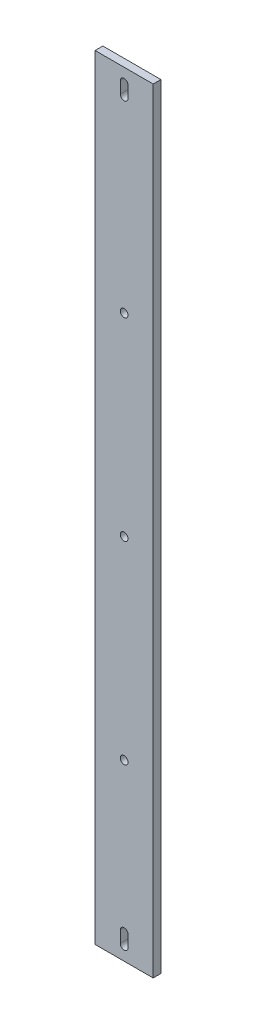
ISO-10303-21;
HEADER;
FILE_DESCRIPTION(('STEP AP214'),'2;1');
FILE_NAME('part.step','',(''),(''),'','','');
FILE_SCHEMA(('AUTOMOTIVE_DESIGN { 1 0 10303 214 1 1 1 1 }'));
ENDSEC;
DATA;
#1=APPLICATION_CONTEXT('core data for automotive mechanical design processes');
#2=APPLICATION_PROTOCOL_DEFINITION('international standard','automotive_design',2000,#1);
#3=PRODUCT_CONTEXT('',#1,'mechanical');
#4=PRODUCT('Part','Part','',(#3));
#5=PRODUCT_RELATED_PRODUCT_CATEGORY('part','',(#4));
#6=PRODUCT_DEFINITION_FORMATION('','',#4);
#7=PRODUCT_DEFINITION_CONTEXT('part definition',#1,'design');
#8=PRODUCT_DEFINITION('design','',#6,#7);
#9=PRODUCT_DEFINITION_SHAPE('','',#8);
#10=(LENGTH_UNIT() NAMED_UNIT(*) SI_UNIT(.MILLI.,.METRE.));
#11=(NAMED_UNIT(*) PLANE_ANGLE_UNIT() SI_UNIT($,.RADIAN.));
#12=(NAMED_UNIT(*) SI_UNIT($,.STERADIAN.) SOLID_ANGLE_UNIT());
#13=UNCERTAINTY_MEASURE_WITH_UNIT(LENGTH_MEASURE(1.E-05),#10,'distance_accuracy_value','');
#14=(GEOMETRIC_REPRESENTATION_CONTEXT(3) GLOBAL_UNCERTAINTY_ASSIGNED_CONTEXT((#13)) GLOBAL_UNIT_ASSIGNED_CONTEXT((#10,
#11,#12)) REPRESENTATION_CONTEXT('',''));
#15=CARTESIAN_POINT('',(0.,0.,0.));
#16=DIRECTION('',(0.,0.,1.));
#17=DIRECTION('',(1.,0.,0.));
#18=AXIS2_PLACEMENT_3D('',#15,#16,#17);
#19=CARTESIAN_POINT('',(-52.5896783947224,52.5,4.));
#20=DIRECTION('',(1.,0.,0.));
#21=DIRECTION('',(0.,1.,0.));
#22=AXIS2_PLACEMENT_3D('',#19,#20,#21);
#23=PLANE('',#22);
#24=DIRECTION('',(0.,-1.,0.));
#25=VECTOR('',#24,1.);
#26=CARTESIAN_POINT('',(-52.5896783947224,52.5,0.));
#27=LINE('',#26,#25);
#28=CARTESIAN_POINT('',(-52.5896783947224,52.5,0.));
#29=VERTEX_POINT('',#28);
#30=CARTESIAN_POINT('',(-52.5896783947223,-347.5,0.));
#31=VERTEX_POINT('',#30);
#32=EDGE_CURVE('E193',#29,#31,#27,.T.);
#33=ORIENTED_EDGE('',*,*,#32,.T.);
#34=DIRECTION('',(0.,0.,-1.));
#35=VECTOR('',#34,1.);
#36=CARTESIAN_POINT('',(-52.5896783947223,-347.5,4.));
#37=LINE('',#36,#35);
#38=CARTESIAN_POINT('',(-52.5896783947223,-347.5,4.));
#39=VERTEX_POINT('',#38);
#40=EDGE_CURVE('E11',#39,#31,#37,.T.);
#41=ORIENTED_EDGE('',*,*,#40,.F.);
#42=DIRECTION('',(0.,-1.,0.));
#43=VECTOR('',#42,1.);
#44=CARTESIAN_POINT('',(-52.5896783947224,52.5,4.));
#45=LINE('',#44,#43);
#46=CARTESIAN_POINT('',(-52.5896783947224,52.5,4.));
#47=VERTEX_POINT('',#46);
#48=EDGE_CURVE('E200',#47,#39,#45,.T.);
#49=ORIENTED_EDGE('',*,*,#48,.F.);
#50=DIRECTION('',(0.,0.,-1.));
#51=VECTOR('',#50,1.);
#52=CARTESIAN_POINT('',(-52.5896783947224,52.5,4.));
#53=LINE('',#52,#51);
#54=EDGE_CURVE('E210',#47,#29,#53,.T.);
#55=ORIENTED_EDGE('',*,*,#54,.T.);
#56=EDGE_LOOP('',(#33,#41,#49,#55));
#57=FACE_BOUND('',#56,.T.);
#58=ADVANCED_FACE('F33',(#57),#23,.F.);
#59=CARTESIAN_POINT('',(-52.5896783947223,-347.5,4.));
#60=DIRECTION('',(0.,1.,0.));
#61=DIRECTION('',(0.,0.,1.));
#62=AXIS2_PLACEMENT_3D('',#59,#60,#61);
#63=PLANE('',#62);
#64=DIRECTION('',(1.,0.,0.));
#65=VECTOR('',#64,1.);
#66=CARTESIAN_POINT('',(-52.5896783947223,-347.5,0.));
#67=LINE('',#66,#65);
#68=CARTESIAN_POINT('',(-22.5896783947223,-347.5,0.));
#69=VERTEX_POINT('',#68);
#70=EDGE_CURVE('E213',#31,#69,#67,.T.);
#71=ORIENTED_EDGE('',*,*,#70,.T.);
#72=DIRECTION('',(0.,0.,-1.));
#73=VECTOR('',#72,1.);
#74=CARTESIAN_POINT('',(-22.5896783947223,-347.5,4.));
#75=LINE('',#74,#73);
#76=CARTESIAN_POINT('',(-22.5896783947223,-347.5,4.));
#77=VERTEX_POINT('',#76);
#78=EDGE_CURVE('E40',#77,#69,#75,.T.);
#79=ORIENTED_EDGE('',*,*,#78,.F.);
#80=DIRECTION('',(1.,0.,0.));
#81=VECTOR('',#80,1.);
#82=CARTESIAN_POINT('',(-52.5896783947223,-347.5,4.));
#83=LINE('',#82,#81);
#84=EDGE_CURVE('E203',#39,#77,#83,.T.);
#85=ORIENTED_EDGE('',*,*,#84,.F.);
#86=ORIENTED_EDGE('',*,*,#40,.T.);
#87=EDGE_LOOP('',(#71,#79,#85,#86));
#88=FACE_BOUND('',#87,.T.);
#89=ADVANCED_FACE('F242',(#88),#63,.F.);
#90=CARTESIAN_POINT('',(-22.5896783947224,52.5,4.));
#91=DIRECTION('',(-1.,0.,0.));
#92=DIRECTION('',(0.,-1.,0.));
#93=AXIS2_PLACEMENT_3D('',#90,#91,#92);
#94=PLANE('',#93);
#95=DIRECTION('',(0.,1.,0.));
#96=VECTOR('',#95,1.);
#97=CARTESIAN_POINT('',(-22.5896783947224,52.5,0.));
#98=LINE('',#97,#96);
#99=CARTESIAN_POINT('',(-22.5896783947224,52.5,0.));
#100=VERTEX_POINT('',#99);
#101=EDGE_CURVE('E215',#69,#100,#98,.T.);
#102=ORIENTED_EDGE('',*,*,#101,.T.);
#103=DIRECTION('',(0.,0.,-1.));
#104=VECTOR('',#103,1.);
#105=CARTESIAN_POINT('',(-22.5896783947224,52.5,4.));
#106=LINE('',#105,#104);
#107=CARTESIAN_POINT('',(-22.5896783947224,52.5,4.));
#108=VERTEX_POINT('',#107);
#109=EDGE_CURVE('E220',#108,#100,#106,.T.);
#110=ORIENTED_EDGE('',*,*,#109,.F.);
#111=DIRECTION('',(0.,1.,0.));
#112=VECTOR('',#111,1.);
#113=CARTESIAN_POINT('',(-22.5896783947224,52.5,4.));
#114=LINE('',#113,#112);
#115=EDGE_CURVE('E206',#77,#108,#114,.T.);
#116=ORIENTED_EDGE('',*,*,#115,.F.);
#117=ORIENTED_EDGE('',*,*,#78,.T.);
#118=EDGE_LOOP('',(#102,#110,#116,#117));
#119=FACE_BOUND('',#118,.T.);
#120=ADVANCED_FACE('F227',(#119),#94,.F.);
#121=CARTESIAN_POINT('',(-52.5896783947224,52.5,4.));
#122=DIRECTION('',(0.,-1.,0.));
#123=DIRECTION('',(0.,0.,-1.));
#124=AXIS2_PLACEMENT_3D('',#121,#122,#123);
#125=PLANE('',#124);
#126=DIRECTION('',(-1.,0.,0.));
#127=VECTOR('',#126,1.);
#128=CARTESIAN_POINT('',(-52.5896783947224,52.5,0.));
#129=LINE('',#128,#127);
#130=EDGE_CURVE('E204',#100,#29,#129,.T.);
#131=ORIENTED_EDGE('',*,*,#130,.T.);
#132=ORIENTED_EDGE('',*,*,#54,.F.);
#133=DIRECTION('',(-1.,0.,0.));
#134=VECTOR('',#133,1.);
#135=CARTESIAN_POINT('',(-52.5896783947224,52.5,4.));
#136=LINE('',#135,#134);
#137=EDGE_CURVE('E208',#108,#47,#136,.T.);
#138=ORIENTED_EDGE('',*,*,#137,.F.);
#139=ORIENTED_EDGE('',*,*,#109,.T.);
#140=EDGE_LOOP('',(#131,#132,#138,#139));
#141=FACE_BOUND('',#140,.T.);
#142=ADVANCED_FACE('F235',(#141),#125,.F.);
#143=CARTESIAN_POINT('',(0.,0.,4.));
#144=DIRECTION('',(0.,0.,1.));
#145=DIRECTION('',(1.,0.,0.));
#146=AXIS2_PLACEMENT_3D('',#143,#144,#145);
#147=PLANE('',#146);
#148=CARTESIAN_POINT('',(-37.5896783947224,-157.5,4.));
#149=DIRECTION('',(0.,0.,1.));
#150=DIRECTION('',(1.,0.,0.));
#151=AXIS2_PLACEMENT_3D('',#148,#149,#150);
#152=CIRCLE('',#151,2.);
#153=CARTESIAN_POINT('',(-35.5896783947224,-157.5,4.));
#154=VERTEX_POINT('',#153);
#155=EDGE_CURVE('E304',#154,#154,#152,.T.);
#156=ORIENTED_EDGE('',*,*,#155,.F.);
#157=EDGE_LOOP('',(#156));
#158=FACE_BOUND('',#157,.T.);
#159=CARTESIAN_POINT('',(-37.5896783947224,-257.5,4.));
#160=DIRECTION('',(0.,0.,1.));
#161=DIRECTION('',(1.,0.,0.));
#162=AXIS2_PLACEMENT_3D('',#159,#160,#161);
#163=CIRCLE('',#162,1.99999999999996);
#164=CARTESIAN_POINT('',(-35.5896783947224,-257.5,4.));
#165=VERTEX_POINT('',#164);
#166=EDGE_CURVE('E145',#165,#165,#163,.T.);
#167=ORIENTED_EDGE('',*,*,#166,.F.);
#168=EDGE_LOOP('',(#167));
#169=FACE_BOUND('',#168,.T.);
#170=CARTESIAN_POINT('',(-37.5896783947224,-340.5,4.));
#171=DIRECTION('',(0.,0.,1.));
#172=DIRECTION('',(-1.,0.,0.));
#173=AXIS2_PLACEMENT_3D('',#170,#171,#172);
#174=CIRCLE('',#173,2.00000000000026);
#175=CARTESIAN_POINT('',(-39.5896783947223,-340.500001065561,4.));
#176=VERTEX_POINT('',#175);
#177=CARTESIAN_POINT('',(-35.5896783947224,-340.500001065561,4.));
#178=VERTEX_POINT('',#177);
#179=EDGE_CURVE('E47',#176,#178,#174,.T.);
#180=ORIENTED_EDGE('',*,*,#179,.F.);
#181=DIRECTION('',(0.,-1.,0.));
#182=VECTOR('',#181,1.);
#183=CARTESIAN_POINT('',(-39.5896783947223,-334.499998934439,4.));
#184=LINE('',#183,#182);
#185=CARTESIAN_POINT('',(-39.5896783947223,-334.499998934439,4.));
#186=VERTEX_POINT('',#185);
#187=EDGE_CURVE('E139',#186,#176,#184,.T.);
#188=ORIENTED_EDGE('',*,*,#187,.F.);
#189=CARTESIAN_POINT('',(-37.5896783947224,-334.499998934439,4.));
#190=DIRECTION('',(0.,0.,1.));
#191=DIRECTION('',(1.,0.,0.));
#192=AXIS2_PLACEMENT_3D('',#189,#190,#191);
#193=CIRCLE('',#192,1.99999999999998);
#194=CARTESIAN_POINT('',(-35.5896783947224,-334.499998934439,4.));
#195=VERTEX_POINT('',#194);
#196=EDGE_CURVE('E142',#195,#186,#193,.T.);
#197=ORIENTED_EDGE('',*,*,#196,.F.);
#198=DIRECTION('',(0.,1.,0.));
#199=VECTOR('',#198,1.);
#200=CARTESIAN_POINT('',(-35.5896783947224,-334.499998934439,4.));
#201=LINE('',#200,#199);
#202=EDGE_CURVE('E151',#178,#195,#201,.T.);
#203=ORIENTED_EDGE('',*,*,#202,.F.);
#204=EDGE_LOOP('',(#180,#188,#197,#203));
#205=FACE_BOUND('',#204,.T.);
#206=CARTESIAN_POINT('',(-37.5896783947224,-57.5,4.));
#207=DIRECTION('',(0.,0.,1.));
#208=DIRECTION('',(1.,0.,0.));
#209=AXIS2_PLACEMENT_3D('',#206,#207,#208);
#210=CIRCLE('',#209,2.);
#211=CARTESIAN_POINT('',(-35.5896783947224,-57.5,4.));
#212=VERTEX_POINT('',#211);
#213=EDGE_CURVE('E158',#212,#212,#210,.T.);
#214=ORIENTED_EDGE('',*,*,#213,.F.);
#215=EDGE_LOOP('',(#214));
#216=FACE_BOUND('',#215,.T.);
#217=CARTESIAN_POINT('',(-37.5896783947223,45.5,4.));
#218=DIRECTION('',(0.,0.,1.));
#219=DIRECTION('',(1.,0.,0.));
#220=AXIS2_PLACEMENT_3D('',#217,#218,#219);
#221=CIRCLE('',#220,2.);
#222=CARTESIAN_POINT('',(-35.5896783947223,45.5,4.));
#223=VERTEX_POINT('',#222);
#224=CARTESIAN_POINT('',(-39.5896783947223,45.5,4.));
#225=VERTEX_POINT('',#224);
#226=EDGE_CURVE('E165',#223,#225,#221,.T.);
#227=ORIENTED_EDGE('',*,*,#226,.F.);
#228=DIRECTION('',(0.,1.,0.));
#229=VECTOR('',#228,1.);
#230=CARTESIAN_POINT('',(-35.5896783947223,45.5,4.));
#231=LINE('',#230,#229);
#232=CARTESIAN_POINT('',(-35.5896783947223,39.5,4.));
#233=VERTEX_POINT('',#232);
#234=EDGE_CURVE('E172',#233,#223,#231,.T.);
#235=ORIENTED_EDGE('',*,*,#234,.F.);
#236=CARTESIAN_POINT('',(-37.5896783947224,39.5,4.));
#237=DIRECTION('',(0.,0.,1.));
#238=DIRECTION('',(-1.,0.,0.));
#239=AXIS2_PLACEMENT_3D('',#236,#237,#238);
#240=CIRCLE('',#239,2.);
#241=CARTESIAN_POINT('',(-39.5896783947224,39.5,4.));
#242=VERTEX_POINT('',#241);
#243=EDGE_CURVE('E186',#242,#233,#240,.T.);
#244=ORIENTED_EDGE('',*,*,#243,.F.);
#245=DIRECTION('',(0.,-1.,0.));
#246=VECTOR('',#245,1.);
#247=CARTESIAN_POINT('',(-39.5896783947223,45.5,4.));
#248=LINE('',#247,#246);
#249=EDGE_CURVE('E183',#225,#242,#248,.T.);
#250=ORIENTED_EDGE('',*,*,#249,.F.);
#251=EDGE_LOOP('',(#227,#235,#244,#250));
#252=FACE_BOUND('',#251,.T.);
#253=ORIENTED_EDGE('',*,*,#48,.T.);
#254=ORIENTED_EDGE('',*,*,#84,.T.);
#255=ORIENTED_EDGE('',*,*,#115,.T.);
#256=ORIENTED_EDGE('',*,*,#137,.T.);
#257=EDGE_LOOP('',(#253,#254,#255,#256));
#258=FACE_BOUND('',#257,.T.);
#259=ADVANCED_FACE('F241',(#158,#169,#205,#216,#252,#258),#147,.T.);
#260=CARTESIAN_POINT('',(0.,0.,0.));
#261=DIRECTION('',(0.,0.,1.));
#262=DIRECTION('',(1.,0.,0.));
#263=AXIS2_PLACEMENT_3D('',#260,#261,#262);
#264=PLANE('',#263);
#265=CARTESIAN_POINT('',(-37.5896783947224,-157.5,0.));
#266=DIRECTION('',(0.,0.,1.));
#267=DIRECTION('',(1.,0.,0.));
#268=AXIS2_PLACEMENT_3D('',#265,#266,#267);
#269=CIRCLE('',#268,2.);
#270=CARTESIAN_POINT('',(-35.5896783947224,-157.5,0.));
#271=VERTEX_POINT('',#270);
#272=EDGE_CURVE('E301',#271,#271,#269,.T.);
#273=ORIENTED_EDGE('',*,*,#272,.T.);
#274=EDGE_LOOP('',(#273));
#275=FACE_BOUND('',#274,.T.);
#276=CARTESIAN_POINT('',(-37.5896783947224,-257.5,0.));
#277=DIRECTION('',(0.,0.,1.));
#278=DIRECTION('',(1.,0.,0.));
#279=AXIS2_PLACEMENT_3D('',#276,#277,#278);
#280=CIRCLE('',#279,1.99999999999996);
#281=CARTESIAN_POINT('',(-35.5896783947224,-257.5,0.));
#282=VERTEX_POINT('',#281);
#283=EDGE_CURVE('E152',#282,#282,#280,.T.);
#284=ORIENTED_EDGE('',*,*,#283,.T.);
#285=EDGE_LOOP('',(#284));
#286=FACE_BOUND('',#285,.T.);
#287=DIRECTION('',(0.,-1.,0.));
#288=VECTOR('',#287,1.);
#289=CARTESIAN_POINT('',(-39.5896783947223,-334.499998934439,0.));
#290=LINE('',#289,#288);
#291=CARTESIAN_POINT('',(-39.5896783947223,-334.499998934439,0.));
#292=VERTEX_POINT('',#291);
#293=CARTESIAN_POINT('',(-39.5896783947223,-340.500001065561,0.));
#294=VERTEX_POINT('',#293);
#295=EDGE_CURVE('E129',#292,#294,#290,.T.);
#296=ORIENTED_EDGE('',*,*,#295,.T.);
#297=CARTESIAN_POINT('',(-37.5896783947224,-340.5,0.));
#298=DIRECTION('',(0.,0.,1.));
#299=DIRECTION('',(-1.,0.,0.));
#300=AXIS2_PLACEMENT_3D('',#297,#298,#299);
#301=CIRCLE('',#300,2.00000000000026);
#302=CARTESIAN_POINT('',(-35.5896783947224,-340.500001065561,0.));
#303=VERTEX_POINT('',#302);
#304=EDGE_CURVE('E123',#294,#303,#301,.T.);
#305=ORIENTED_EDGE('',*,*,#304,.T.);
#306=DIRECTION('',(0.,1.,0.));
#307=VECTOR('',#306,1.);
#308=CARTESIAN_POINT('',(-35.5896783947224,-334.499998934439,0.));
#309=LINE('',#308,#307);
#310=CARTESIAN_POINT('',(-35.5896783947224,-334.499998934439,0.));
#311=VERTEX_POINT('',#310);
#312=EDGE_CURVE('E132',#303,#311,#309,.T.);
#313=ORIENTED_EDGE('',*,*,#312,.T.);
#314=CARTESIAN_POINT('',(-37.5896783947224,-334.499998934439,0.));
#315=DIRECTION('',(0.,0.,1.));
#316=DIRECTION('',(1.,0.,0.));
#317=AXIS2_PLACEMENT_3D('',#314,#315,#316);
#318=CIRCLE('',#317,1.99999999999998);
#319=EDGE_CURVE('E55',#311,#292,#318,.T.);
#320=ORIENTED_EDGE('',*,*,#319,.T.);
#321=EDGE_LOOP('',(#296,#305,#313,#320));
#322=FACE_BOUND('',#321,.T.);
#323=CARTESIAN_POINT('',(-37.5896783947224,-57.5,0.));
#324=DIRECTION('',(0.,0.,1.));
#325=DIRECTION('',(1.,0.,0.));
#326=AXIS2_PLACEMENT_3D('',#323,#324,#325);
#327=CIRCLE('',#326,2.);
#328=CARTESIAN_POINT('',(-35.5896783947224,-57.5,0.));
#329=VERTEX_POINT('',#328);
#330=EDGE_CURVE('E162',#329,#329,#327,.T.);
#331=ORIENTED_EDGE('',*,*,#330,.T.);
#332=EDGE_LOOP('',(#331));
#333=FACE_BOUND('',#332,.T.);
#334=DIRECTION('',(0.,1.,0.));
#335=VECTOR('',#334,1.);
#336=CARTESIAN_POINT('',(-35.5896783947223,45.5,0.));
#337=LINE('',#336,#335);
#338=CARTESIAN_POINT('',(-35.5896783947223,39.5,0.));
#339=VERTEX_POINT('',#338);
#340=CARTESIAN_POINT('',(-35.5896783947223,45.5,0.));
#341=VERTEX_POINT('',#340);
#342=EDGE_CURVE('E178',#339,#341,#337,.T.);
#343=ORIENTED_EDGE('',*,*,#342,.T.);
#344=CARTESIAN_POINT('',(-37.5896783947223,45.5,0.));
#345=DIRECTION('',(0.,0.,1.));
#346=DIRECTION('',(1.,0.,0.));
#347=AXIS2_PLACEMENT_3D('',#344,#345,#346);
#348=CIRCLE('',#347,2.);
#349=CARTESIAN_POINT('',(-39.5896783947223,45.5,0.));
#350=VERTEX_POINT('',#349);
#351=EDGE_CURVE('E168',#341,#350,#348,.T.);
#352=ORIENTED_EDGE('',*,*,#351,.T.);
#353=DIRECTION('',(0.,-1.,0.));
#354=VECTOR('',#353,1.);
#355=CARTESIAN_POINT('',(-39.5896783947223,45.5,0.));
#356=LINE('',#355,#354);
#357=CARTESIAN_POINT('',(-39.5896783947223,39.5,0.));
#358=VERTEX_POINT('',#357);
#359=EDGE_CURVE('E171',#350,#358,#356,.T.);
#360=ORIENTED_EDGE('',*,*,#359,.T.);
#361=CARTESIAN_POINT('',(-37.5896783947224,39.5,0.));
#362=DIRECTION('',(0.,0.,1.));
#363=DIRECTION('',(-1.,0.,0.));
#364=AXIS2_PLACEMENT_3D('',#361,#362,#363);
#365=CIRCLE('',#364,2.);
#366=EDGE_CURVE('E175',#358,#339,#365,.T.);
#367=ORIENTED_EDGE('',*,*,#366,.T.);
#368=EDGE_LOOP('',(#343,#352,#360,#367));
#369=FACE_BOUND('',#368,.T.);
#370=ORIENTED_EDGE('',*,*,#32,.F.);
#371=ORIENTED_EDGE('',*,*,#130,.F.);
#372=ORIENTED_EDGE('',*,*,#101,.F.);
#373=ORIENTED_EDGE('',*,*,#70,.F.);
#374=EDGE_LOOP('',(#370,#371,#372,#373));
#375=FACE_BOUND('',#374,.T.);
#376=ADVANCED_FACE('F136',(#275,#286,#322,#333,#369,#375),#264,.F.);
#377=CARTESIAN_POINT('',(-37.5896783947223,45.5,0.));
#378=DIRECTION('',(0.,0.,1.));
#379=DIRECTION('',(1.,0.,0.));
#380=AXIS2_PLACEMENT_3D('',#377,#378,#379);
#381=CYLINDRICAL_SURFACE('',#380,2.);
#382=ORIENTED_EDGE('',*,*,#226,.T.);
#383=DIRECTION('',(0.,0.,1.));
#384=VECTOR('',#383,1.);
#385=CARTESIAN_POINT('',(-39.5896783947223,45.5,0.));
#386=LINE('',#385,#384);
#387=EDGE_CURVE('E181',#350,#225,#386,.T.);
#388=ORIENTED_EDGE('',*,*,#387,.F.);
#389=ORIENTED_EDGE('',*,*,#351,.F.);
#390=DIRECTION('',(0.,0.,1.));
#391=VECTOR('',#390,1.);
#392=CARTESIAN_POINT('',(-35.5896783947223,45.5,0.));
#393=LINE('',#392,#391);
#394=EDGE_CURVE('E191',#341,#223,#393,.T.);
#395=ORIENTED_EDGE('',*,*,#394,.T.);
#396=EDGE_LOOP('',(#382,#388,#389,#395));
#397=FACE_BOUND('',#396,.T.);
#398=ADVANCED_FACE('F254',(#397),#381,.F.);
#399=CARTESIAN_POINT('',(-35.5896783947223,45.5,0.));
#400=DIRECTION('',(1.,0.,0.));
#401=DIRECTION('',(0.,0.,-1.));
#402=AXIS2_PLACEMENT_3D('',#399,#400,#401);
#403=PLANE('',#402);
#404=ORIENTED_EDGE('',*,*,#234,.T.);
#405=ORIENTED_EDGE('',*,*,#394,.F.);
#406=ORIENTED_EDGE('',*,*,#342,.F.);
#407=DIRECTION('',(0.,0.,1.));
#408=VECTOR('',#407,1.);
#409=CARTESIAN_POINT('',(-35.5896783947223,39.5,0.));
#410=LINE('',#409,#408);
#411=EDGE_CURVE('E194',#339,#233,#410,.T.);
#412=ORIENTED_EDGE('',*,*,#411,.T.);
#413=EDGE_LOOP('',(#404,#405,#406,#412));
#414=FACE_BOUND('',#413,.T.);
#415=ADVANCED_FACE('F261',(#414),#403,.F.);
#416=CARTESIAN_POINT('',(-37.5896783947224,39.5,0.));
#417=DIRECTION('',(0.,0.,1.));
#418=DIRECTION('',(1.,0.,0.));
#419=AXIS2_PLACEMENT_3D('',#416,#417,#418);
#420=CYLINDRICAL_SURFACE('',#419,2.);
#421=ORIENTED_EDGE('',*,*,#243,.T.);
#422=ORIENTED_EDGE('',*,*,#411,.F.);
#423=ORIENTED_EDGE('',*,*,#366,.F.);
#424=DIRECTION('',(0.,0.,1.));
#425=VECTOR('',#424,1.);
#426=CARTESIAN_POINT('',(-39.5896783947224,39.5,0.));
#427=LINE('',#426,#425);
#428=EDGE_CURVE('E196',#358,#242,#427,.T.);
#429=ORIENTED_EDGE('',*,*,#428,.T.);
#430=EDGE_LOOP('',(#421,#422,#423,#429));
#431=FACE_BOUND('',#430,.T.);
#432=ADVANCED_FACE('F267',(#431),#420,.F.);
#433=CARTESIAN_POINT('',(-39.5896783947223,45.5,0.));
#434=DIRECTION('',(-1.,0.,0.));
#435=DIRECTION('',(0.,0.,1.));
#436=AXIS2_PLACEMENT_3D('',#433,#434,#435);
#437=PLANE('',#436);
#438=ORIENTED_EDGE('',*,*,#249,.T.);
#439=ORIENTED_EDGE('',*,*,#428,.F.);
#440=ORIENTED_EDGE('',*,*,#359,.F.);
#441=ORIENTED_EDGE('',*,*,#387,.T.);
#442=EDGE_LOOP('',(#438,#439,#440,#441));
#443=FACE_BOUND('',#442,.T.);
#444=ADVANCED_FACE('F263',(#443),#437,.F.);
#445=CARTESIAN_POINT('',(-37.5896783947224,-57.5,0.));
#446=DIRECTION('',(0.,0.,1.));
#447=DIRECTION('',(1.,0.,0.));
#448=AXIS2_PLACEMENT_3D('',#445,#446,#447);
#449=CYLINDRICAL_SURFACE('',#448,2.);
#450=ORIENTED_EDGE('',*,*,#330,.F.);
#451=EDGE_LOOP('',(#450));
#452=FACE_BOUND('',#451,.T.);
#453=ORIENTED_EDGE('',*,*,#213,.T.);
#454=EDGE_LOOP('',(#453));
#455=FACE_BOUND('',#454,.T.);
#456=ADVANCED_FACE('F266',(#452,#455),#449,.F.);
#457=CARTESIAN_POINT('',(-37.5896783947224,-340.5,0.));
#458=DIRECTION('',(0.,0.,1.));
#459=DIRECTION('',(1.,0.,0.));
#460=AXIS2_PLACEMENT_3D('',#457,#458,#459);
#461=CYLINDRICAL_SURFACE('',#460,2.00000000000026);
#462=ORIENTED_EDGE('',*,*,#179,.T.);
#463=DIRECTION('',(0.,0.,1.));
#464=VECTOR('',#463,1.);
#465=CARTESIAN_POINT('',(-35.5896783947224,-340.500001065561,0.));
#466=LINE('',#465,#464);
#467=EDGE_CURVE('E119',#303,#178,#466,.T.);
#468=ORIENTED_EDGE('',*,*,#467,.F.);
#469=ORIENTED_EDGE('',*,*,#304,.F.);
#470=DIRECTION('',(0.,0.,1.));
#471=VECTOR('',#470,1.);
#472=CARTESIAN_POINT('',(-39.5896783947223,-340.500001065561,0.));
#473=LINE('',#472,#471);
#474=EDGE_CURVE('E156',#294,#176,#473,.T.);
#475=ORIENTED_EDGE('',*,*,#474,.T.);
#476=EDGE_LOOP('',(#462,#468,#469,#475));
#477=FACE_BOUND('',#476,.T.);
#478=ADVANCED_FACE('F121',(#477),#461,.F.);
#479=CARTESIAN_POINT('',(-39.5896783947223,-334.499998934439,0.));
#480=DIRECTION('',(-1.,0.,0.));
#481=DIRECTION('',(0.,0.,1.));
#482=AXIS2_PLACEMENT_3D('',#479,#480,#481);
#483=PLANE('',#482);
#484=ORIENTED_EDGE('',*,*,#187,.T.);
#485=ORIENTED_EDGE('',*,*,#474,.F.);
#486=ORIENTED_EDGE('',*,*,#295,.F.);
#487=DIRECTION('',(0.,0.,1.));
#488=VECTOR('',#487,1.);
#489=CARTESIAN_POINT('',(-39.5896783947223,-334.499998934439,0.));
#490=LINE('',#489,#488);
#491=EDGE_CURVE('E159',#292,#186,#490,.T.);
#492=ORIENTED_EDGE('',*,*,#491,.T.);
#493=EDGE_LOOP('',(#484,#485,#486,#492));
#494=FACE_BOUND('',#493,.T.);
#495=ADVANCED_FACE('F280',(#494),#483,.F.);
#496=CARTESIAN_POINT('',(-37.5896783947224,-334.499998934439,0.));
#497=DIRECTION('',(0.,0.,1.));
#498=DIRECTION('',(1.,0.,0.));
#499=AXIS2_PLACEMENT_3D('',#496,#497,#498);
#500=CYLINDRICAL_SURFACE('',#499,1.99999999999998);
#501=ORIENTED_EDGE('',*,*,#196,.T.);
#502=ORIENTED_EDGE('',*,*,#491,.F.);
#503=ORIENTED_EDGE('',*,*,#319,.F.);
#504=DIRECTION('',(0.,0.,1.));
#505=VECTOR('',#504,1.);
#506=CARTESIAN_POINT('',(-35.5896783947224,-334.499998934439,0.));
#507=LINE('',#506,#505);
#508=EDGE_CURVE('E128',#311,#195,#507,.T.);
#509=ORIENTED_EDGE('',*,*,#508,.T.);
#510=EDGE_LOOP('',(#501,#502,#503,#509));
#511=FACE_BOUND('',#510,.T.);
#512=ADVANCED_FACE('F284',(#511),#500,.F.);
#513=CARTESIAN_POINT('',(-35.5896783947224,-334.499998934439,0.));
#514=DIRECTION('',(1.,0.,0.));
#515=DIRECTION('',(0.,0.,-1.));
#516=AXIS2_PLACEMENT_3D('',#513,#514,#515);
#517=PLANE('',#516);
#518=ORIENTED_EDGE('',*,*,#202,.T.);
#519=ORIENTED_EDGE('',*,*,#508,.F.);
#520=ORIENTED_EDGE('',*,*,#312,.F.);
#521=ORIENTED_EDGE('',*,*,#467,.T.);
#522=EDGE_LOOP('',(#518,#519,#520,#521));
#523=FACE_BOUND('',#522,.T.);
#524=ADVANCED_FACE('F133',(#523),#517,.F.);
#525=CARTESIAN_POINT('',(-37.5896783947224,-257.5,0.));
#526=DIRECTION('',(0.,0.,1.));
#527=DIRECTION('',(1.,0.,0.));
#528=AXIS2_PLACEMENT_3D('',#525,#526,#527);
#529=CYLINDRICAL_SURFACE('',#528,1.99999999999996);
#530=ORIENTED_EDGE('',*,*,#283,.F.);
#531=EDGE_LOOP('',(#530));
#532=FACE_BOUND('',#531,.T.);
#533=ORIENTED_EDGE('',*,*,#166,.T.);
#534=EDGE_LOOP('',(#533));
#535=FACE_BOUND('',#534,.T.);
#536=ADVANCED_FACE('F283',(#532,#535),#529,.F.);
#537=CARTESIAN_POINT('',(-37.5896783947224,-157.5,0.));
#538=DIRECTION('',(0.,0.,1.));
#539=DIRECTION('',(1.,0.,0.));
#540=AXIS2_PLACEMENT_3D('',#537,#538,#539);
#541=CYLINDRICAL_SURFACE('',#540,2.);
#542=ORIENTED_EDGE('',*,*,#272,.F.);
#543=EDGE_LOOP('',(#542));
#544=FACE_BOUND('',#543,.T.);
#545=ORIENTED_EDGE('',*,*,#155,.T.);
#546=EDGE_LOOP('',(#545));
#547=FACE_BOUND('',#546,.T.);
#548=ADVANCED_FACE('F292',(#544,#547),#541,.F.);
#549=CLOSED_SHELL('',(#58,#89,#120,#142,#259,#376,#398,#415,#432,#444,#456,#478,#495,#512,#524,
#536,#548));
#550=MANIFOLD_SOLID_BREP('B2',#549);
#551=ADVANCED_BREP_SHAPE_REPRESENTATION('',(#18,#550),#14);
#552=SHAPE_DEFINITION_REPRESENTATION(#9,#551);
ENDSEC;
END-ISO-10303-21;
